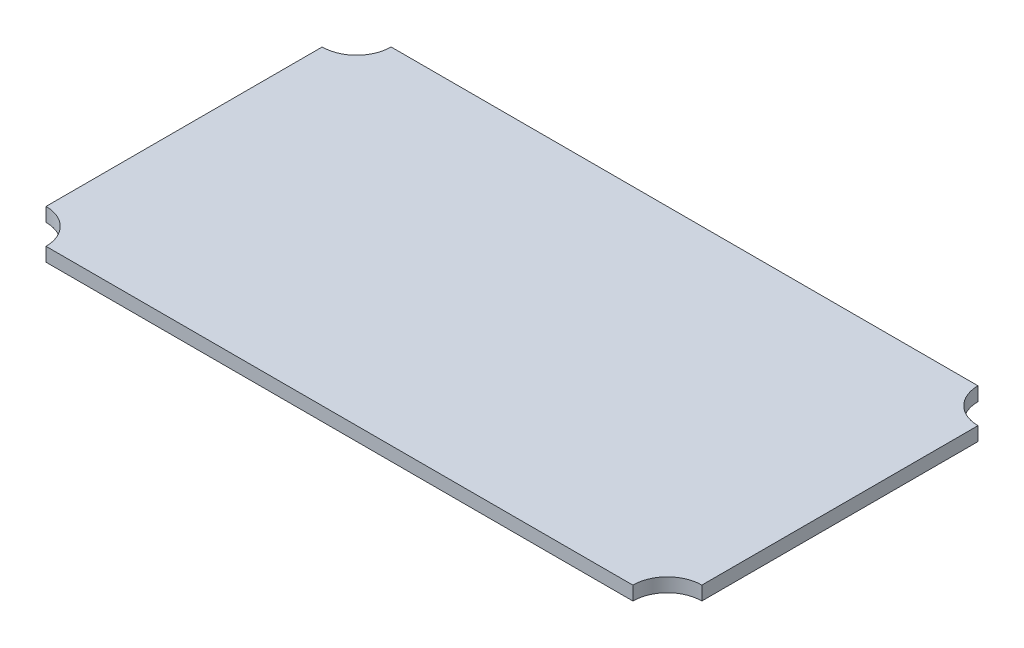
ISO-10303-21;
HEADER;
FILE_DESCRIPTION(('STEP AP214'),'2;1');
FILE_NAME('part.step','',(''),(''),'','','');
FILE_SCHEMA(('AUTOMOTIVE_DESIGN { 1 0 10303 214 1 1 1 1 }'));
ENDSEC;
DATA;
#1=APPLICATION_CONTEXT('core data for automotive mechanical design processes');
#2=APPLICATION_PROTOCOL_DEFINITION('international standard','automotive_design',2000,#1);
#3=PRODUCT_CONTEXT('',#1,'mechanical');
#4=PRODUCT('Part','Part','',(#3));
#5=PRODUCT_RELATED_PRODUCT_CATEGORY('part','',(#4));
#6=PRODUCT_DEFINITION_FORMATION('','',#4);
#7=PRODUCT_DEFINITION_CONTEXT('part definition',#1,'design');
#8=PRODUCT_DEFINITION('design','',#6,#7);
#9=PRODUCT_DEFINITION_SHAPE('','',#8);
#10=(LENGTH_UNIT() NAMED_UNIT(*) SI_UNIT(.MILLI.,.METRE.));
#11=(NAMED_UNIT(*) PLANE_ANGLE_UNIT() SI_UNIT($,.RADIAN.));
#12=(NAMED_UNIT(*) SI_UNIT($,.STERADIAN.) SOLID_ANGLE_UNIT());
#13=UNCERTAINTY_MEASURE_WITH_UNIT(LENGTH_MEASURE(1.E-05),#10,'distance_accuracy_value','');
#14=(GEOMETRIC_REPRESENTATION_CONTEXT(3) GLOBAL_UNCERTAINTY_ASSIGNED_CONTEXT((#13)) GLOBAL_UNIT_ASSIGNED_CONTEXT((#10,
#11,#12)) REPRESENTATION_CONTEXT('',''));
#15=CARTESIAN_POINT('',(0.,0.,0.));
#16=DIRECTION('',(0.,0.,1.));
#17=DIRECTION('',(1.,0.,0.));
#18=AXIS2_PLACEMENT_3D('',#15,#16,#17);
#19=CARTESIAN_POINT('',(47.5,1.,25.));
#20=DIRECTION('',(-1.,0.,0.));
#21=DIRECTION('',(0.,0.,1.));
#22=AXIS2_PLACEMENT_3D('',#19,#20,#21);
#23=PLANE('',#22);
#24=DIRECTION('',(0.,0.,-1.));
#25=VECTOR('',#24,1.);
#26=CARTESIAN_POINT('',(47.5,-1.,25.));
#27=LINE('',#26,#25);
#28=CARTESIAN_POINT('',(47.5000000000004,-1.,20.0000000000004));
#29=VERTEX_POINT('',#28);
#30=CARTESIAN_POINT('',(47.5,-1.,-19.9999999999996));
#31=VERTEX_POINT('',#30);
#32=EDGE_CURVE('E141',#29,#31,#27,.T.);
#33=ORIENTED_EDGE('',*,*,#32,.T.);
#34=DIRECTION('',(0.,1.,0.));
#35=VECTOR('',#34,1.);
#36=CARTESIAN_POINT('',(47.5000000000004,-3.5000000000008,-19.9999999999996));
#37=LINE('',#36,#35);
#38=CARTESIAN_POINT('',(47.5000000000004,0.999999999999997,-19.9999999999996));
#39=VERTEX_POINT('',#38);
#40=EDGE_CURVE('E136',#31,#39,#37,.T.);
#41=ORIENTED_EDGE('',*,*,#40,.T.);
#42=DIRECTION('',(0.,0.,-1.));
#43=VECTOR('',#42,1.);
#44=CARTESIAN_POINT('',(47.5,1.,25.));
#45=LINE('',#44,#43);
#46=CARTESIAN_POINT('',(47.5000000000004,0.999999999999996,20.0000000000004));
#47=VERTEX_POINT('',#46);
#48=EDGE_CURVE('E115',#47,#39,#45,.T.);
#49=ORIENTED_EDGE('',*,*,#48,.F.);
#50=DIRECTION('',(0.,1.,0.));
#51=VECTOR('',#50,1.);
#52=CARTESIAN_POINT('',(47.5000000000004,-3.50000000000082,20.0000000000004));
#53=LINE('',#52,#51);
#54=EDGE_CURVE('E99',#29,#47,#53,.T.);
#55=ORIENTED_EDGE('',*,*,#54,.F.);
#56=EDGE_LOOP('',(#33,#41,#49,#55));
#57=FACE_BOUND('',#56,.T.);
#58=ADVANCED_FACE('F32',(#57),#23,.F.);
#59=CARTESIAN_POINT('',(-47.5,1.,-25.));
#60=DIRECTION('',(0.,0.,1.));
#61=DIRECTION('',(1.,0.,0.));
#62=AXIS2_PLACEMENT_3D('',#59,#60,#61);
#63=PLANE('',#62);
#64=DIRECTION('',(0.,1.,0.));
#65=VECTOR('',#64,1.);
#66=CARTESIAN_POINT('',(-42.4999999999996,-3.50000000000083,-24.9999999999996));
#67=LINE('',#66,#65);
#68=CARTESIAN_POINT('',(-42.4999999999996,-1.,-25.));
#69=VERTEX_POINT('',#68);
#70=CARTESIAN_POINT('',(-42.4999999999996,0.999999999999997,-24.9999999999996));
#71=VERTEX_POINT('',#70);
#72=EDGE_CURVE('E132',#69,#71,#67,.T.);
#73=ORIENTED_EDGE('',*,*,#72,.T.);
#74=DIRECTION('',(-1.,0.,0.));
#75=VECTOR('',#74,1.);
#76=CARTESIAN_POINT('',(-47.5,1.,-25.));
#77=LINE('',#76,#75);
#78=CARTESIAN_POINT('',(42.5000000000004,0.999999999999996,-24.9999999999996));
#79=VERTEX_POINT('',#78);
#80=EDGE_CURVE('E127',#79,#71,#77,.T.);
#81=ORIENTED_EDGE('',*,*,#80,.F.);
#82=DIRECTION('',(0.,1.,0.));
#83=VECTOR('',#82,1.);
#84=CARTESIAN_POINT('',(42.5000000000004,-3.5000000000008,-24.9999999999996));
#85=LINE('',#84,#83);
#86=CARTESIAN_POINT('',(42.5000000000004,-1.,-24.9999999999996));
#87=VERTEX_POINT('',#86);
#88=EDGE_CURVE('E125',#87,#79,#85,.T.);
#89=ORIENTED_EDGE('',*,*,#88,.F.);
#90=DIRECTION('',(-1.,0.,0.));
#91=VECTOR('',#90,1.);
#92=CARTESIAN_POINT('',(-47.5,-1.,-25.));
#93=LINE('',#92,#91);
#94=EDGE_CURVE('E135',#87,#69,#93,.T.);
#95=ORIENTED_EDGE('',*,*,#94,.T.);
#96=EDGE_LOOP('',(#73,#81,#89,#95));
#97=FACE_BOUND('',#96,.T.);
#98=ADVANCED_FACE('F169',(#97),#63,.F.);
#99=CARTESIAN_POINT('',(-47.5,1.,25.));
#100=DIRECTION('',(1.,0.,0.));
#101=DIRECTION('',(0.,0.,-1.));
#102=AXIS2_PLACEMENT_3D('',#99,#100,#101);
#103=PLANE('',#102);
#104=DIRECTION('',(0.,0.,1.));
#105=VECTOR('',#104,1.);
#106=CARTESIAN_POINT('',(-47.5,-1.,25.));
#107=LINE('',#106,#105);
#108=CARTESIAN_POINT('',(-47.4999999999996,-1.,-19.9999999999996));
#109=VERTEX_POINT('',#108);
#110=CARTESIAN_POINT('',(-47.5,-1.,20.0000000000004));
#111=VERTEX_POINT('',#110);
#112=EDGE_CURVE('E130',#109,#111,#107,.T.);
#113=ORIENTED_EDGE('',*,*,#112,.T.);
#114=DIRECTION('',(0.,1.,0.));
#115=VECTOR('',#114,1.);
#116=CARTESIAN_POINT('',(-47.4999999999996,-3.50000000000085,20.0000000000004));
#117=LINE('',#116,#115);
#118=CARTESIAN_POINT('',(-47.4999999999996,0.999999999999996,20.0000000000004));
#119=VERTEX_POINT('',#118);
#120=EDGE_CURVE('E87',#111,#119,#117,.T.);
#121=ORIENTED_EDGE('',*,*,#120,.T.);
#122=DIRECTION('',(0.,0.,1.));
#123=VECTOR('',#122,1.);
#124=CARTESIAN_POINT('',(-47.5,1.,25.));
#125=LINE('',#124,#123);
#126=CARTESIAN_POINT('',(-47.4999999999996,0.999999999999997,-19.9999999999996));
#127=VERTEX_POINT('',#126);
#128=EDGE_CURVE('E111',#127,#119,#125,.T.);
#129=ORIENTED_EDGE('',*,*,#128,.F.);
#130=DIRECTION('',(0.,1.,0.));
#131=VECTOR('',#130,1.);
#132=CARTESIAN_POINT('',(-47.4999999999996,-3.50000000000083,-19.9999999999996));
#133=LINE('',#132,#131);
#134=EDGE_CURVE('E124',#109,#127,#133,.T.);
#135=ORIENTED_EDGE('',*,*,#134,.F.);
#136=EDGE_LOOP('',(#113,#121,#129,#135));
#137=FACE_BOUND('',#136,.T.);
#138=ADVANCED_FACE('F176',(#137),#103,.F.);
#139=CARTESIAN_POINT('',(-47.5,1.,25.));
#140=DIRECTION('',(0.,0.,-1.));
#141=DIRECTION('',(-1.,0.,0.));
#142=AXIS2_PLACEMENT_3D('',#139,#140,#141);
#143=PLANE('',#142);
#144=DIRECTION('',(1.,0.,0.));
#145=VECTOR('',#144,1.);
#146=CARTESIAN_POINT('',(-47.5,1.,25.));
#147=LINE('',#146,#145);
#148=CARTESIAN_POINT('',(-42.4999999999996,0.999999999999997,25.0000000000004));
#149=VERTEX_POINT('',#148);
#150=CARTESIAN_POINT('',(42.5000000000004,0.999999999999996,25.0000000000004));
#151=VERTEX_POINT('',#150);
#152=EDGE_CURVE('E35',#149,#151,#147,.T.);
#153=ORIENTED_EDGE('',*,*,#152,.F.);
#154=DIRECTION('',(0.,1.,0.));
#155=VECTOR('',#154,1.);
#156=CARTESIAN_POINT('',(-42.4999999999996,-3.50000000000085,25.0000000000004));
#157=LINE('',#156,#155);
#158=CARTESIAN_POINT('',(-42.4999999999996,-1.,25.0000000000004));
#159=VERTEX_POINT('',#158);
#160=EDGE_CURVE('E11',#159,#149,#157,.T.);
#161=ORIENTED_EDGE('',*,*,#160,.F.);
#162=DIRECTION('',(1.,0.,0.));
#163=VECTOR('',#162,1.);
#164=CARTESIAN_POINT('',(-47.5,-1.,25.));
#165=LINE('',#164,#163);
#166=CARTESIAN_POINT('',(42.5000000000004,-1.,25.));
#167=VERTEX_POINT('',#166);
#168=EDGE_CURVE('E110',#159,#167,#165,.T.);
#169=ORIENTED_EDGE('',*,*,#168,.T.);
#170=DIRECTION('',(0.,1.,0.));
#171=VECTOR('',#170,1.);
#172=CARTESIAN_POINT('',(42.5000000000004,-3.50000000000082,25.0000000000004));
#173=LINE('',#172,#171);
#174=EDGE_CURVE('E93',#167,#151,#173,.T.);
#175=ORIENTED_EDGE('',*,*,#174,.T.);
#176=EDGE_LOOP('',(#153,#161,#169,#175));
#177=FACE_BOUND('',#176,.T.);
#178=ADVANCED_FACE('F108',(#177),#143,.F.);
#179=CARTESIAN_POINT('',(0.,1.,0.));
#180=DIRECTION('',(0.,-1.,0.));
#181=DIRECTION('',(0.,0.,-1.));
#182=AXIS2_PLACEMENT_3D('',#179,#180,#181);
#183=PLANE('',#182);
#184=ORIENTED_EDGE('',*,*,#128,.T.);
#185=CARTESIAN_POINT('',(-47.4999999999996,1.,25.0000000000004));
#186=DIRECTION('',(0.,-1.,0.));
#187=DIRECTION('',(0.,0.,-1.));
#188=AXIS2_PLACEMENT_3D('',#185,#186,#187);
#189=CIRCLE('',#188,5.);
#190=EDGE_CURVE('E49',#119,#149,#189,.T.);
#191=ORIENTED_EDGE('',*,*,#190,.T.);
#192=ORIENTED_EDGE('',*,*,#152,.T.);
#193=CARTESIAN_POINT('',(47.5000000000004,1.,25.0000000000004));
#194=DIRECTION('',(0.,-1.,0.));
#195=DIRECTION('',(0.,0.,-1.));
#196=AXIS2_PLACEMENT_3D('',#193,#194,#195);
#197=CIRCLE('',#196,5.);
#198=EDGE_CURVE('E96',#47,#151,#197,.F.);
#199=ORIENTED_EDGE('',*,*,#198,.F.);
#200=ORIENTED_EDGE('',*,*,#48,.T.);
#201=CARTESIAN_POINT('',(47.5000000000004,1.,-24.9999999999996));
#202=DIRECTION('',(0.,-1.,0.));
#203=DIRECTION('',(0.,0.,-1.));
#204=AXIS2_PLACEMENT_3D('',#201,#202,#203);
#205=CIRCLE('',#204,5.);
#206=EDGE_CURVE('E116',#39,#79,#205,.T.);
#207=ORIENTED_EDGE('',*,*,#206,.T.);
#208=ORIENTED_EDGE('',*,*,#80,.T.);
#209=CARTESIAN_POINT('',(-47.4999999999996,1.,-24.9999999999996));
#210=DIRECTION('',(0.,-1.,0.));
#211=DIRECTION('',(0.,0.,-1.));
#212=AXIS2_PLACEMENT_3D('',#209,#210,#211);
#213=CIRCLE('',#212,5.);
#214=EDGE_CURVE('E122',#127,#71,#213,.F.);
#215=ORIENTED_EDGE('',*,*,#214,.F.);
#216=EDGE_LOOP('',(#184,#191,#192,#199,#200,#207,#208,#215));
#217=FACE_BOUND('',#216,.T.);
#218=ADVANCED_FACE('F114',(#217),#183,.F.);
#219=CARTESIAN_POINT('',(0.,-1.,0.));
#220=DIRECTION('',(0.,-1.,0.));
#221=DIRECTION('',(0.,0.,-1.));
#222=AXIS2_PLACEMENT_3D('',#219,#220,#221);
#223=PLANE('',#222);
#224=CARTESIAN_POINT('',(-47.4999999999996,-1.,25.0000000000004));
#225=DIRECTION('',(0.,-1.,0.));
#226=DIRECTION('',(0.,0.,-1.));
#227=AXIS2_PLACEMENT_3D('',#224,#225,#226);
#228=CIRCLE('',#227,5.);
#229=EDGE_CURVE('E41',#111,#159,#228,.T.);
#230=ORIENTED_EDGE('',*,*,#229,.F.);
#231=ORIENTED_EDGE('',*,*,#112,.F.);
#232=CARTESIAN_POINT('',(-47.4999999999996,-1.,-24.9999999999996));
#233=DIRECTION('',(0.,-1.,0.));
#234=DIRECTION('',(0.,0.,-1.));
#235=AXIS2_PLACEMENT_3D('',#232,#233,#234);
#236=CIRCLE('',#235,5.);
#237=EDGE_CURVE('E149',#109,#69,#236,.F.);
#238=ORIENTED_EDGE('',*,*,#237,.T.);
#239=ORIENTED_EDGE('',*,*,#94,.F.);
#240=CARTESIAN_POINT('',(47.5000000000004,-1.,-24.9999999999996));
#241=DIRECTION('',(0.,-1.,0.));
#242=DIRECTION('',(0.,0.,-1.));
#243=AXIS2_PLACEMENT_3D('',#240,#241,#242);
#244=CIRCLE('',#243,5.);
#245=EDGE_CURVE('E138',#31,#87,#244,.T.);
#246=ORIENTED_EDGE('',*,*,#245,.F.);
#247=ORIENTED_EDGE('',*,*,#32,.F.);
#248=CARTESIAN_POINT('',(47.5000000000004,-1.,25.0000000000004));
#249=DIRECTION('',(0.,-1.,0.));
#250=DIRECTION('',(0.,0.,-1.));
#251=AXIS2_PLACEMENT_3D('',#248,#249,#250);
#252=CIRCLE('',#251,5.);
#253=EDGE_CURVE('E103',#29,#167,#252,.F.);
#254=ORIENTED_EDGE('',*,*,#253,.T.);
#255=ORIENTED_EDGE('',*,*,#168,.F.);
#256=EDGE_LOOP('',(#230,#231,#238,#239,#246,#247,#254,#255));
#257=FACE_BOUND('',#256,.T.);
#258=ADVANCED_FACE('F157',(#257),#223,.T.);
#259=CARTESIAN_POINT('',(47.5000000000004,-3.50000000000082,25.0000000000004));
#260=DIRECTION('',(0.,1.,0.));
#261=DIRECTION('',(-1.,0.,0.));
#262=AXIS2_PLACEMENT_3D('',#259,#260,#261);
#263=CYLINDRICAL_SURFACE('',#262,5.);
#264=ORIENTED_EDGE('',*,*,#198,.T.);
#265=ORIENTED_EDGE('',*,*,#174,.F.);
#266=ORIENTED_EDGE('',*,*,#253,.F.);
#267=ORIENTED_EDGE('',*,*,#54,.T.);
#268=EDGE_LOOP('',(#264,#265,#266,#267));
#269=FACE_BOUND('',#268,.T.);
#270=ADVANCED_FACE('F97',(#269),#263,.F.);
#271=CARTESIAN_POINT('',(47.5000000000004,-3.5000000000008,-24.9999999999996));
#272=DIRECTION('',(0.,1.,0.));
#273=DIRECTION('',(-1.,0.,0.));
#274=AXIS2_PLACEMENT_3D('',#271,#272,#273);
#275=CYLINDRICAL_SURFACE('',#274,5.);
#276=ORIENTED_EDGE('',*,*,#40,.F.);
#277=ORIENTED_EDGE('',*,*,#245,.T.);
#278=ORIENTED_EDGE('',*,*,#88,.T.);
#279=ORIENTED_EDGE('',*,*,#206,.F.);
#280=EDGE_LOOP('',(#276,#277,#278,#279));
#281=FACE_BOUND('',#280,.T.);
#282=ADVANCED_FACE('F172',(#281),#275,.F.);
#283=CARTESIAN_POINT('',(-47.4999999999996,-3.50000000000083,-24.9999999999996));
#284=DIRECTION('',(0.,1.,0.));
#285=DIRECTION('',(-1.,0.,0.));
#286=AXIS2_PLACEMENT_3D('',#283,#284,#285);
#287=CYLINDRICAL_SURFACE('',#286,5.);
#288=ORIENTED_EDGE('',*,*,#214,.T.);
#289=ORIENTED_EDGE('',*,*,#72,.F.);
#290=ORIENTED_EDGE('',*,*,#237,.F.);
#291=ORIENTED_EDGE('',*,*,#134,.T.);
#292=EDGE_LOOP('',(#288,#289,#290,#291));
#293=FACE_BOUND('',#292,.T.);
#294=ADVANCED_FACE('F177',(#293),#287,.F.);
#295=CARTESIAN_POINT('',(-47.4999999999996,-3.50000000000085,25.0000000000004));
#296=DIRECTION('',(0.,1.,0.));
#297=DIRECTION('',(-1.,0.,0.));
#298=AXIS2_PLACEMENT_3D('',#295,#296,#297);
#299=CYLINDRICAL_SURFACE('',#298,5.);
#300=ORIENTED_EDGE('',*,*,#120,.F.);
#301=ORIENTED_EDGE('',*,*,#229,.T.);
#302=ORIENTED_EDGE('',*,*,#160,.T.);
#303=ORIENTED_EDGE('',*,*,#190,.F.);
#304=EDGE_LOOP('',(#300,#301,#302,#303));
#305=FACE_BOUND('',#304,.T.);
#306=ADVANCED_FACE('F179',(#305),#299,.F.);
#307=CLOSED_SHELL('',(#58,#98,#138,#178,#218,#258,#270,#282,#294,#306));
#308=MANIFOLD_SOLID_BREP('B2',#307);
#309=ADVANCED_BREP_SHAPE_REPRESENTATION('',(#18,#308),#14);
#310=SHAPE_DEFINITION_REPRESENTATION(#9,#309);
ENDSEC;
END-ISO-10303-21;
